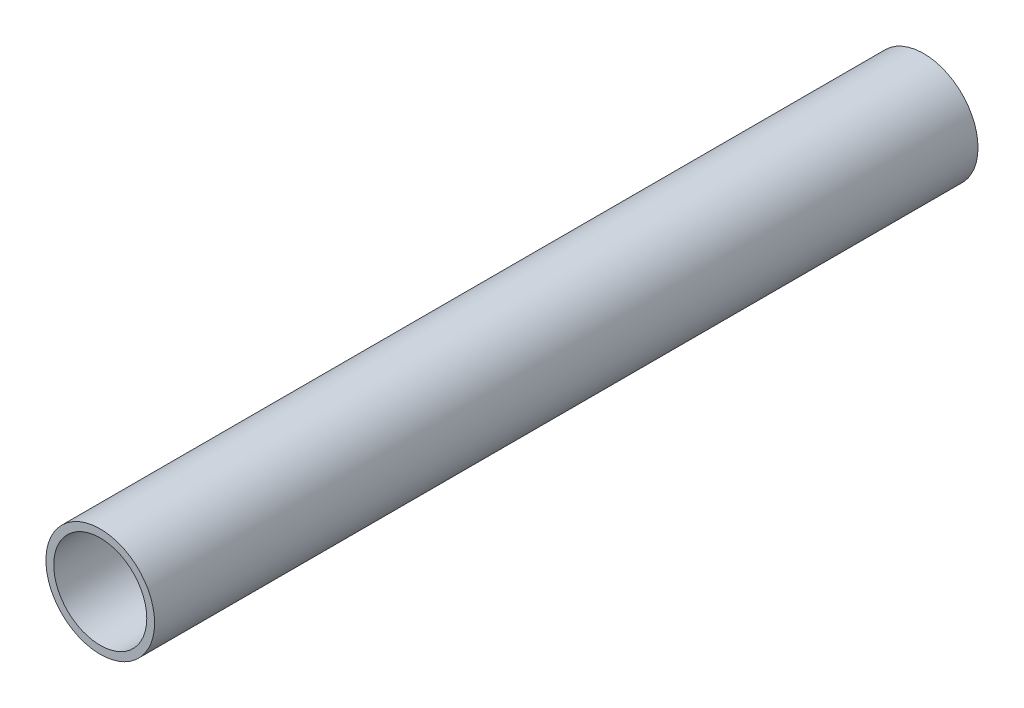
ISO-10303-21;
HEADER;
FILE_DESCRIPTION(('STEP AP214'),'2;1');
FILE_NAME('part.step','',(''),(''),'','','');
FILE_SCHEMA(('AUTOMOTIVE_DESIGN { 1 0 10303 214 1 1 1 1 }'));
ENDSEC;
DATA;
#1=APPLICATION_CONTEXT('core data for automotive mechanical design processes');
#2=APPLICATION_PROTOCOL_DEFINITION('international standard','automotive_design',2000,#1);
#3=PRODUCT_CONTEXT('',#1,'mechanical');
#4=PRODUCT('Part','Part','',(#3));
#5=PRODUCT_RELATED_PRODUCT_CATEGORY('part','',(#4));
#6=PRODUCT_DEFINITION_FORMATION('','',#4);
#7=PRODUCT_DEFINITION_CONTEXT('part definition',#1,'design');
#8=PRODUCT_DEFINITION('design','',#6,#7);
#9=PRODUCT_DEFINITION_SHAPE('','',#8);
#10=(LENGTH_UNIT() NAMED_UNIT(*) SI_UNIT(.MILLI.,.METRE.));
#11=(NAMED_UNIT(*) PLANE_ANGLE_UNIT() SI_UNIT($,.RADIAN.));
#12=(NAMED_UNIT(*) SI_UNIT($,.STERADIAN.) SOLID_ANGLE_UNIT());
#13=UNCERTAINTY_MEASURE_WITH_UNIT(LENGTH_MEASURE(1.E-05),#10,'distance_accuracy_value','');
#14=(GEOMETRIC_REPRESENTATION_CONTEXT(3) GLOBAL_UNCERTAINTY_ASSIGNED_CONTEXT((#13)) GLOBAL_UNIT_ASSIGNED_CONTEXT((#10,
#11,#12)) REPRESENTATION_CONTEXT('',''));
#15=CARTESIAN_POINT('',(0.,0.,0.));
#16=DIRECTION('',(0.,0.,1.));
#17=DIRECTION('',(1.,0.,0.));
#18=AXIS2_PLACEMENT_3D('',#15,#16,#17);
#19=CARTESIAN_POINT('',(-1.53281553150464,2.49134831028641,-150.958127897661));
#20=DIRECTION('',(0.,0.,1.));
#21=DIRECTION('',(1.,0.,0.));
#22=AXIS2_PLACEMENT_3D('',#19,#20,#21);
#23=CYLINDRICAL_SURFACE('',#22,19.8);
#24=CARTESIAN_POINT('',(-1.53281553150464,2.49134831028641,-150.958127897661));
#25=DIRECTION('',(0.,0.,1.));
#26=DIRECTION('',(1.,0.,0.));
#27=AXIS2_PLACEMENT_3D('',#24,#25,#26);
#28=CIRCLE('',#27,19.8);
#29=CARTESIAN_POINT('',(18.2671844684954,2.49134831028641,-150.958127897661));
#30=VERTEX_POINT('',#29);
#31=EDGE_CURVE('E8',#30,#30,#28,.T.);
#32=ORIENTED_EDGE('',*,*,#31,.T.);
#33=EDGE_LOOP('',(#32));
#34=FACE_BOUND('',#33,.T.);
#35=CARTESIAN_POINT('',(-1.53281553150464,2.49134831028641,149.041872102339));
#36=DIRECTION('',(0.,0.,1.));
#37=DIRECTION('',(1.,0.,0.));
#38=AXIS2_PLACEMENT_3D('',#35,#36,#37);
#39=CIRCLE('',#38,19.8);
#40=CARTESIAN_POINT('',(18.2671844684954,2.49134831028641,149.041872102339));
#41=VERTEX_POINT('',#40);
#42=EDGE_CURVE('E16',#41,#41,#39,.T.);
#43=ORIENTED_EDGE('',*,*,#42,.F.);
#44=EDGE_LOOP('',(#43));
#45=FACE_BOUND('',#44,.T.);
#46=ADVANCED_FACE('F13',(#34,#45),#23,.T.);
#47=CARTESIAN_POINT('',(-1.53281553150464,2.49134831028641,-150.958127897661));
#48=DIRECTION('',(0.,0.,1.));
#49=DIRECTION('',(1.,0.,0.));
#50=AXIS2_PLACEMENT_3D('',#47,#48,#49);
#51=PLANE('',#50);
#52=CARTESIAN_POINT('',(-1.53281553150464,2.49134831028641,-150.958127897661));
#53=DIRECTION('',(0.,0.,1.));
#54=DIRECTION('',(1.,0.,0.));
#55=AXIS2_PLACEMENT_3D('',#52,#53,#54);
#56=CIRCLE('',#55,16.95);
#57=CARTESIAN_POINT('',(15.4171844684954,2.49134831028641,-150.958127897661));
#58=VERTEX_POINT('',#57);
#59=EDGE_CURVE('E23',#58,#58,#56,.T.);
#60=ORIENTED_EDGE('',*,*,#59,.T.);
#61=EDGE_LOOP('',(#60));
#62=FACE_BOUND('',#61,.T.);
#63=ORIENTED_EDGE('',*,*,#31,.F.);
#64=EDGE_LOOP('',(#63));
#65=FACE_BOUND('',#64,.T.);
#66=ADVANCED_FACE('F31',(#62,#65),#51,.F.);
#67=CARTESIAN_POINT('',(-1.53281553150464,2.49134831028641,149.041872102339));
#68=DIRECTION('',(0.,0.,1.));
#69=DIRECTION('',(1.,0.,0.));
#70=AXIS2_PLACEMENT_3D('',#67,#68,#69);
#71=PLANE('',#70);
#72=CARTESIAN_POINT('',(-1.53281553150464,2.49134831028641,149.041872102339));
#73=DIRECTION('',(0.,0.,1.));
#74=DIRECTION('',(1.,0.,0.));
#75=AXIS2_PLACEMENT_3D('',#72,#73,#74);
#76=CIRCLE('',#75,16.95);
#77=CARTESIAN_POINT('',(15.4171844684954,2.49134831028641,149.041872102339));
#78=VERTEX_POINT('',#77);
#79=EDGE_CURVE('E25',#78,#78,#76,.T.);
#80=ORIENTED_EDGE('',*,*,#79,.F.);
#81=EDGE_LOOP('',(#80));
#82=FACE_BOUND('',#81,.T.);
#83=ORIENTED_EDGE('',*,*,#42,.T.);
#84=EDGE_LOOP('',(#83));
#85=FACE_BOUND('',#84,.T.);
#86=ADVANCED_FACE('F37',(#82,#85),#71,.T.);
#87=CARTESIAN_POINT('',(-1.53281553150464,2.49134831028641,-150.958127897661));
#88=DIRECTION('',(0.,0.,1.));
#89=DIRECTION('',(1.,0.,0.));
#90=AXIS2_PLACEMENT_3D('',#87,#88,#89);
#91=CYLINDRICAL_SURFACE('',#90,16.95);
#92=ORIENTED_EDGE('',*,*,#59,.F.);
#93=EDGE_LOOP('',(#92));
#94=FACE_BOUND('',#93,.T.);
#95=ORIENTED_EDGE('',*,*,#79,.T.);
#96=EDGE_LOOP('',(#95));
#97=FACE_BOUND('',#96,.T.);
#98=ADVANCED_FACE('F34',(#94,#97),#91,.F.);
#99=CLOSED_SHELL('',(#46,#66,#86,#98));
#100=MANIFOLD_SOLID_BREP('B1',#99);
#101=ADVANCED_BREP_SHAPE_REPRESENTATION('',(#18,#100),#14);
#102=SHAPE_DEFINITION_REPRESENTATION(#9,#101);
ENDSEC;
END-ISO-10303-21;
